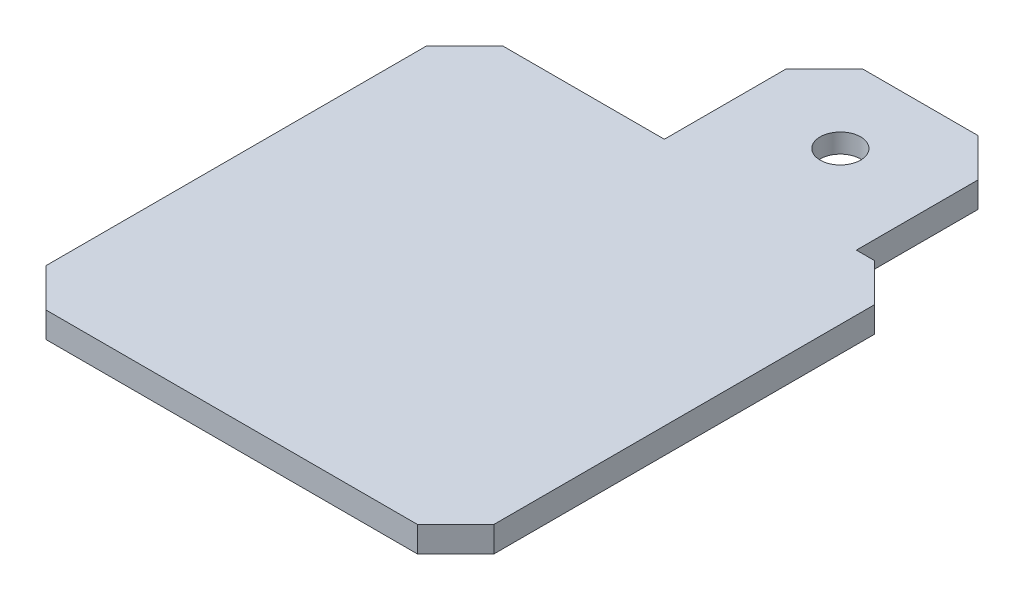
ISO-10303-21;
HEADER;
FILE_DESCRIPTION(('STEP AP214'),'2;1');
FILE_NAME('part.step','',(''),(''),'','','');
FILE_SCHEMA(('AUTOMOTIVE_DESIGN { 1 0 10303 214 1 1 1 1 }'));
ENDSEC;
DATA;
#1=APPLICATION_CONTEXT('core data for automotive mechanical design processes');
#2=APPLICATION_PROTOCOL_DEFINITION('international standard','automotive_design',2000,#1);
#3=PRODUCT_CONTEXT('',#1,'mechanical');
#4=PRODUCT('Part','Part','',(#3));
#5=PRODUCT_RELATED_PRODUCT_CATEGORY('part','',(#4));
#6=PRODUCT_DEFINITION_FORMATION('','',#4);
#7=PRODUCT_DEFINITION_CONTEXT('part definition',#1,'design');
#8=PRODUCT_DEFINITION('design','',#6,#7);
#9=PRODUCT_DEFINITION_SHAPE('','',#8);
#10=(LENGTH_UNIT() NAMED_UNIT(*) SI_UNIT(.MILLI.,.METRE.));
#11=(NAMED_UNIT(*) PLANE_ANGLE_UNIT() SI_UNIT($,.RADIAN.));
#12=(NAMED_UNIT(*) SI_UNIT($,.STERADIAN.) SOLID_ANGLE_UNIT());
#13=UNCERTAINTY_MEASURE_WITH_UNIT(LENGTH_MEASURE(1.E-05),#10,'distance_accuracy_value','');
#14=(GEOMETRIC_REPRESENTATION_CONTEXT(3) GLOBAL_UNCERTAINTY_ASSIGNED_CONTEXT((#13)) GLOBAL_UNIT_ASSIGNED_CONTEXT((#10,
#11,#12)) REPRESENTATION_CONTEXT('',''));
#15=CARTESIAN_POINT('',(0.,0.,0.));
#16=DIRECTION('',(0.,0.,1.));
#17=DIRECTION('',(1.,0.,0.));
#18=AXIS2_PLACEMENT_3D('',#15,#16,#17);
#19=CARTESIAN_POINT('',(5.6,2.,-23.75));
#20=DIRECTION('',(0.,-1.,0.));
#21=DIRECTION('',(0.,0.,-1.));
#22=AXIS2_PLACEMENT_3D('',#19,#20,#21);
#23=CYLINDRICAL_SURFACE('',#22,2.6);
#24=CARTESIAN_POINT('',(5.6,0.,-23.75));
#25=DIRECTION('',(0.,1.,0.));
#26=DIRECTION('',(0.,0.,1.));
#27=AXIS2_PLACEMENT_3D('',#24,#25,#26);
#28=CIRCLE('',#27,2.6);
#29=CARTESIAN_POINT('',(5.6,0.,-21.15));
#30=VERTEX_POINT('',#29);
#31=EDGE_CURVE('E212',#30,#30,#28,.T.);
#32=ORIENTED_EDGE('',*,*,#31,.F.);
#33=EDGE_LOOP('',(#32));
#34=FACE_BOUND('',#33,.T.);
#35=CARTESIAN_POINT('',(5.6,0.5,-23.75));
#36=DIRECTION('',(0.,1.,0.));
#37=DIRECTION('',(0.,0.,1.));
#38=AXIS2_PLACEMENT_3D('',#35,#36,#37);
#39=CIRCLE('',#38,2.6);
#40=CARTESIAN_POINT('',(5.6,0.5,-21.15));
#41=VERTEX_POINT('',#40);
#42=EDGE_CURVE('E193',#41,#41,#39,.T.);
#43=ORIENTED_EDGE('',*,*,#42,.T.);
#44=EDGE_LOOP('',(#43));
#45=FACE_BOUND('',#44,.T.);
#46=ADVANCED_FACE('F49',(#34,#45),#23,.F.);
#47=CARTESIAN_POINT('',(-1.9,2.,0.));
#48=DIRECTION('',(-1.,0.,0.));
#49=DIRECTION('',(0.,0.,1.));
#50=AXIS2_PLACEMENT_3D('',#47,#48,#49);
#51=PLANE('',#50);
#52=DIRECTION('',(0.,0.,-1.));
#53=VECTOR('',#52,1.);
#54=CARTESIAN_POINT('',(-1.9,2.,0.));
#55=LINE('',#54,#53);
#56=CARTESIAN_POINT('',(-1.9,2.,-17.5));
#57=VERTEX_POINT('',#56);
#58=CARTESIAN_POINT('',(-1.9,2.,-27.));
#59=VERTEX_POINT('',#58);
#60=EDGE_CURVE('E165',#57,#59,#55,.T.);
#61=ORIENTED_EDGE('',*,*,#60,.T.);
#62=DIRECTION('',(0.,-1.,0.));
#63=VECTOR('',#62,1.);
#64=CARTESIAN_POINT('',(-1.9,0.,-27.));
#65=LINE('',#64,#63);
#66=CARTESIAN_POINT('',(-1.9,0.,-27.));
#67=VERTEX_POINT('',#66);
#68=EDGE_CURVE('E281',#59,#67,#65,.T.);
#69=ORIENTED_EDGE('',*,*,#68,.T.);
#70=DIRECTION('',(0.,0.,-1.));
#71=VECTOR('',#70,1.);
#72=CARTESIAN_POINT('',(-1.9,0.,0.));
#73=LINE('',#72,#71);
#74=CARTESIAN_POINT('',(-1.9,0.,-17.5));
#75=VERTEX_POINT('',#74);
#76=EDGE_CURVE('E174',#75,#67,#73,.T.);
#77=ORIENTED_EDGE('',*,*,#76,.F.);
#78=DIRECTION('',(0.,-1.,0.));
#79=VECTOR('',#78,1.);
#80=CARTESIAN_POINT('',(-1.9,2.,-17.5));
#81=LINE('',#80,#79);
#82=EDGE_CURVE('E158',#57,#75,#81,.T.);
#83=ORIENTED_EDGE('',*,*,#82,.F.);
#84=EDGE_LOOP('',(#61,#69,#77,#83));
#85=FACE_BOUND('',#84,.T.);
#86=ADVANCED_FACE('F170',(#85),#51,.T.);
#87=CARTESIAN_POINT('',(0.,2.,-17.5));
#88=DIRECTION('',(0.,0.,-1.));
#89=DIRECTION('',(-1.,0.,0.));
#90=AXIS2_PLACEMENT_3D('',#87,#88,#89);
#91=PLANE('',#90);
#92=DIRECTION('',(1.,0.,0.));
#93=VECTOR('',#92,1.);
#94=CARTESIAN_POINT('',(0.,0.,-17.5));
#95=LINE('',#94,#93);
#96=CARTESIAN_POINT('',(-14.5,0.,-17.5));
#97=VERTEX_POINT('',#96);
#98=EDGE_CURVE('E218',#97,#75,#95,.T.);
#99=ORIENTED_EDGE('',*,*,#98,.F.);
#100=DIRECTION('',(0.,1.,0.));
#101=VECTOR('',#100,1.);
#102=CARTESIAN_POINT('',(-14.5,2.,-17.5));
#103=LINE('',#102,#101);
#104=CARTESIAN_POINT('',(-14.5,2.,-17.5));
#105=VERTEX_POINT('',#104);
#106=EDGE_CURVE('E11',#97,#105,#103,.T.);
#107=ORIENTED_EDGE('',*,*,#106,.T.);
#108=DIRECTION('',(1.,0.,0.));
#109=VECTOR('',#108,1.);
#110=CARTESIAN_POINT('',(0.,2.,-17.5));
#111=LINE('',#110,#109);
#112=EDGE_CURVE('E154',#105,#57,#111,.T.);
#113=ORIENTED_EDGE('',*,*,#112,.T.);
#114=ORIENTED_EDGE('',*,*,#82,.T.);
#115=EDGE_LOOP('',(#99,#107,#113,#114));
#116=FACE_BOUND('',#115,.T.);
#117=ADVANCED_FACE('F157',(#116),#91,.T.);
#118=CARTESIAN_POINT('',(-17.5,2.,0.));
#119=DIRECTION('',(-1.,0.,0.));
#120=DIRECTION('',(0.,0.,1.));
#121=AXIS2_PLACEMENT_3D('',#118,#119,#120);
#122=PLANE('',#121);
#123=DIRECTION('',(0.,0.,-1.));
#124=VECTOR('',#123,1.);
#125=CARTESIAN_POINT('',(-17.5,0.,0.));
#126=LINE('',#125,#124);
#127=CARTESIAN_POINT('',(-17.5,0.,15.2));
#128=VERTEX_POINT('',#127);
#129=CARTESIAN_POINT('',(-17.5,0.,-14.5));
#130=VERTEX_POINT('',#129);
#131=EDGE_CURVE('E221',#128,#130,#126,.T.);
#132=ORIENTED_EDGE('',*,*,#131,.F.);
#133=DIRECTION('',(0.,1.,0.));
#134=VECTOR('',#133,1.);
#135=CARTESIAN_POINT('',(-17.5,2.,15.2));
#136=LINE('',#135,#134);
#137=CARTESIAN_POINT('',(-17.5,2.,15.2));
#138=VERTEX_POINT('',#137);
#139=EDGE_CURVE('E59',#128,#138,#136,.T.);
#140=ORIENTED_EDGE('',*,*,#139,.T.);
#141=DIRECTION('',(0.,0.,-1.));
#142=VECTOR('',#141,1.);
#143=CARTESIAN_POINT('',(-17.5,2.,0.));
#144=LINE('',#143,#142);
#145=CARTESIAN_POINT('',(-17.5,2.,-14.5));
#146=VERTEX_POINT('',#145);
#147=EDGE_CURVE('E164',#138,#146,#144,.T.);
#148=ORIENTED_EDGE('',*,*,#147,.T.);
#149=DIRECTION('',(0.,-1.,0.));
#150=VECTOR('',#149,1.);
#151=CARTESIAN_POINT('',(-17.5,2.,-14.5));
#152=LINE('',#151,#150);
#153=EDGE_CURVE('E301',#146,#130,#152,.T.);
#154=ORIENTED_EDGE('',*,*,#153,.T.);
#155=EDGE_LOOP('',(#132,#140,#148,#154));
#156=FACE_BOUND('',#155,.T.);
#157=ADVANCED_FACE('F309',(#156),#122,.T.);
#158=CARTESIAN_POINT('',(0.,2.,18.2));
#159=DIRECTION('',(0.,0.,-1.));
#160=DIRECTION('',(-1.,0.,0.));
#161=AXIS2_PLACEMENT_3D('',#158,#159,#160);
#162=PLANE('',#161);
#163=DIRECTION('',(1.,0.,0.));
#164=VECTOR('',#163,1.);
#165=CARTESIAN_POINT('',(0.,0.,18.2));
#166=LINE('',#165,#164);
#167=CARTESIAN_POINT('',(-14.5,0.,18.2));
#168=VERTEX_POINT('',#167);
#169=CARTESIAN_POINT('',(14.5,0.,18.2));
#170=VERTEX_POINT('',#169);
#171=EDGE_CURVE('E226',#168,#170,#166,.T.);
#172=ORIENTED_EDGE('',*,*,#171,.T.);
#173=DIRECTION('',(0.,1.,0.));
#174=VECTOR('',#173,1.);
#175=CARTESIAN_POINT('',(14.5,2.,18.2));
#176=LINE('',#175,#174);
#177=CARTESIAN_POINT('',(14.5,2.,18.2));
#178=VERTEX_POINT('',#177);
#179=EDGE_CURVE('E294',#170,#178,#176,.T.);
#180=ORIENTED_EDGE('',*,*,#179,.T.);
#181=DIRECTION('',(1.,0.,0.));
#182=VECTOR('',#181,1.);
#183=CARTESIAN_POINT('',(0.,2.,18.2));
#184=LINE('',#183,#182);
#185=CARTESIAN_POINT('',(-14.5,2.,18.2));
#186=VERTEX_POINT('',#185);
#187=EDGE_CURVE('E199',#186,#178,#184,.T.);
#188=ORIENTED_EDGE('',*,*,#187,.F.);
#189=DIRECTION('',(0.,-1.,0.));
#190=VECTOR('',#189,1.);
#191=CARTESIAN_POINT('',(-14.5,0.,18.2));
#192=LINE('',#191,#190);
#193=EDGE_CURVE('E290',#186,#168,#192,.T.);
#194=ORIENTED_EDGE('',*,*,#193,.T.);
#195=EDGE_LOOP('',(#172,#180,#188,#194));
#196=FACE_BOUND('',#195,.T.);
#197=ADVANCED_FACE('F318',(#196),#162,.F.);
#198=CARTESIAN_POINT('',(17.5,2.,0.));
#199=DIRECTION('',(-1.,0.,0.));
#200=DIRECTION('',(0.,0.,1.));
#201=AXIS2_PLACEMENT_3D('',#198,#199,#200);
#202=PLANE('',#201);
#203=DIRECTION('',(0.,0.,-1.));
#204=VECTOR('',#203,1.);
#205=CARTESIAN_POINT('',(17.5,2.,0.));
#206=LINE('',#205,#204);
#207=CARTESIAN_POINT('',(17.5,2.,15.2));
#208=VERTEX_POINT('',#207);
#209=CARTESIAN_POINT('',(17.5,2.,-14.5));
#210=VERTEX_POINT('',#209);
#211=EDGE_CURVE('E203',#208,#210,#206,.T.);
#212=ORIENTED_EDGE('',*,*,#211,.F.);
#213=DIRECTION('',(0.,-1.,0.));
#214=VECTOR('',#213,1.);
#215=CARTESIAN_POINT('',(17.5,2.,15.2));
#216=LINE('',#215,#214);
#217=CARTESIAN_POINT('',(17.5,0.,15.2));
#218=VERTEX_POINT('',#217);
#219=EDGE_CURVE('E286',#208,#218,#216,.T.);
#220=ORIENTED_EDGE('',*,*,#219,.T.);
#221=DIRECTION('',(0.,0.,-1.));
#222=VECTOR('',#221,1.);
#223=CARTESIAN_POINT('',(17.5,0.,0.));
#224=LINE('',#223,#222);
#225=CARTESIAN_POINT('',(17.5,0.,-14.5));
#226=VERTEX_POINT('',#225);
#227=EDGE_CURVE('E230',#218,#226,#224,.T.);
#228=ORIENTED_EDGE('',*,*,#227,.T.);
#229=DIRECTION('',(0.,1.,0.));
#230=VECTOR('',#229,1.);
#231=CARTESIAN_POINT('',(17.5,2.,-14.5));
#232=LINE('',#231,#230);
#233=EDGE_CURVE('E74',#226,#210,#232,.T.);
#234=ORIENTED_EDGE('',*,*,#233,.T.);
#235=EDGE_LOOP('',(#212,#220,#228,#234));
#236=FACE_BOUND('',#235,.T.);
#237=ADVANCED_FACE('F328',(#236),#202,.F.);
#238=CARTESIAN_POINT('',(13.1,2.,-17.5));
#239=VERTEX_POINT('',#238);
#240=CARTESIAN_POINT('',(14.5,2.,-17.5));
#241=VERTEX_POINT('',#240);
#242=EDGE_CURVE('E167',#239,#241,#111,.T.);
#243=ORIENTED_EDGE('',*,*,#242,.T.);
#244=DIRECTION('',(0.,-1.,0.));
#245=VECTOR('',#244,1.);
#246=CARTESIAN_POINT('',(14.5,0.,-17.5));
#247=LINE('',#246,#245);
#248=CARTESIAN_POINT('',(14.5,0.,-17.5));
#249=VERTEX_POINT('',#248);
#250=EDGE_CURVE('E297',#241,#249,#247,.T.);
#251=ORIENTED_EDGE('',*,*,#250,.T.);
#252=CARTESIAN_POINT('',(13.1,0.,-17.5));
#253=VERTEX_POINT('',#252);
#254=EDGE_CURVE('E222',#253,#249,#95,.T.);
#255=ORIENTED_EDGE('',*,*,#254,.F.);
#256=DIRECTION('',(0.,-1.,0.));
#257=VECTOR('',#256,1.);
#258=CARTESIAN_POINT('',(13.1,2.,-17.5));
#259=LINE('',#258,#257);
#260=EDGE_CURVE('E177',#239,#253,#259,.T.);
#261=ORIENTED_EDGE('',*,*,#260,.F.);
#262=EDGE_LOOP('',(#243,#251,#255,#261));
#263=FACE_BOUND('',#262,.T.);
#264=ADVANCED_FACE('F335',(#263),#91,.T.);
#265=CARTESIAN_POINT('',(13.1,2.,0.));
#266=DIRECTION('',(-1.,0.,0.));
#267=DIRECTION('',(0.,0.,1.));
#268=AXIS2_PLACEMENT_3D('',#265,#266,#267);
#269=PLANE('',#268);
#270=DIRECTION('',(0.,0.,-1.));
#271=VECTOR('',#270,1.);
#272=CARTESIAN_POINT('',(13.1,0.,0.));
#273=LINE('',#272,#271);
#274=CARTESIAN_POINT('',(13.1,0.,-27.));
#275=VERTEX_POINT('',#274);
#276=EDGE_CURVE('E190',#253,#275,#273,.T.);
#277=ORIENTED_EDGE('',*,*,#276,.T.);
#278=DIRECTION('',(0.,1.,0.));
#279=VECTOR('',#278,1.);
#280=CARTESIAN_POINT('',(13.1,2.,-27.));
#281=LINE('',#280,#279);
#282=CARTESIAN_POINT('',(13.1,2.,-27.));
#283=VERTEX_POINT('',#282);
#284=EDGE_CURVE('E262',#275,#283,#281,.T.);
#285=ORIENTED_EDGE('',*,*,#284,.T.);
#286=DIRECTION('',(0.,0.,-1.));
#287=VECTOR('',#286,1.);
#288=CARTESIAN_POINT('',(13.1,2.,0.));
#289=LINE('',#288,#287);
#290=EDGE_CURVE('E206',#239,#283,#289,.T.);
#291=ORIENTED_EDGE('',*,*,#290,.F.);
#292=ORIENTED_EDGE('',*,*,#260,.T.);
#293=EDGE_LOOP('',(#277,#285,#291,#292));
#294=FACE_BOUND('',#293,.T.);
#295=ADVANCED_FACE('F362',(#294),#269,.F.);
#296=CARTESIAN_POINT('',(0.,2.,-30.));
#297=DIRECTION('',(0.,0.,1.));
#298=DIRECTION('',(1.,0.,0.));
#299=AXIS2_PLACEMENT_3D('',#296,#297,#298);
#300=PLANE('',#299);
#301=DIRECTION('',(-1.,0.,0.));
#302=VECTOR('',#301,1.);
#303=CARTESIAN_POINT('',(0.,2.,-30.));
#304=LINE('',#303,#302);
#305=CARTESIAN_POINT('',(10.1,2.,-30.));
#306=VERTEX_POINT('',#305);
#307=CARTESIAN_POINT('',(1.09999999999999,2.,-30.));
#308=VERTEX_POINT('',#307);
#309=EDGE_CURVE('E209',#306,#308,#304,.T.);
#310=ORIENTED_EDGE('',*,*,#309,.F.);
#311=DIRECTION('',(0.,-1.,0.));
#312=VECTOR('',#311,1.);
#313=CARTESIAN_POINT('',(10.1,2.,-30.));
#314=LINE('',#313,#312);
#315=CARTESIAN_POINT('',(10.1,0.,-30.));
#316=VERTEX_POINT('',#315);
#317=EDGE_CURVE('E240',#306,#316,#314,.T.);
#318=ORIENTED_EDGE('',*,*,#317,.T.);
#319=DIRECTION('',(-1.,0.,0.));
#320=VECTOR('',#319,1.);
#321=CARTESIAN_POINT('',(0.,0.,-30.));
#322=LINE('',#321,#320);
#323=CARTESIAN_POINT('',(1.09999999999999,0.,-30.));
#324=VERTEX_POINT('',#323);
#325=EDGE_CURVE('E186',#316,#324,#322,.T.);
#326=ORIENTED_EDGE('',*,*,#325,.T.);
#327=DIRECTION('',(0.,1.,0.));
#328=VECTOR('',#327,1.);
#329=CARTESIAN_POINT('',(1.09999999999999,2.,-30.));
#330=LINE('',#329,#328);
#331=EDGE_CURVE('E176',#324,#308,#330,.T.);
#332=ORIENTED_EDGE('',*,*,#331,.T.);
#333=EDGE_LOOP('',(#310,#318,#326,#332));
#334=FACE_BOUND('',#333,.T.);
#335=ADVANCED_FACE('F351',(#334),#300,.F.);
#336=CARTESIAN_POINT('',(0.,2.,0.));
#337=DIRECTION('',(0.,1.,0.));
#338=DIRECTION('',(0.,0.,1.));
#339=AXIS2_PLACEMENT_3D('',#336,#337,#338);
#340=PLANE('',#339);
#341=ORIENTED_EDGE('',*,*,#290,.T.);
#342=DIRECTION('',(0.707106781186546,0.,0.707106781186549));
#343=VECTOR('',#342,1.);
#344=CARTESIAN_POINT('',(20.05,2.,-20.0499999999999));
#345=LINE('',#344,#343);
#346=EDGE_CURVE('E278',#283,#306,#345,.F.);
#347=ORIENTED_EDGE('',*,*,#346,.T.);
#348=ORIENTED_EDGE('',*,*,#309,.T.);
#349=DIRECTION('',(-0.707106781186547,0.,0.707106781186548));
#350=VECTOR('',#349,1.);
#351=CARTESIAN_POINT('',(-14.45,2.,-14.45));
#352=LINE('',#351,#350);
#353=EDGE_CURVE('E184',#308,#59,#352,.T.);
#354=ORIENTED_EDGE('',*,*,#353,.T.);
#355=ORIENTED_EDGE('',*,*,#60,.F.);
#356=ORIENTED_EDGE('',*,*,#112,.F.);
#357=DIRECTION('',(0.707106781186549,0.,-0.707106781186546));
#358=VECTOR('',#357,1.);
#359=CARTESIAN_POINT('',(-16.,2.,-16.));
#360=LINE('',#359,#358);
#361=EDGE_CURVE('E265',#105,#146,#360,.F.);
#362=ORIENTED_EDGE('',*,*,#361,.T.);
#363=ORIENTED_EDGE('',*,*,#147,.F.);
#364=DIRECTION('',(0.707106781186546,0.,0.707106781186549));
#365=VECTOR('',#364,1.);
#366=CARTESIAN_POINT('',(-16.35,2.,16.35));
#367=LINE('',#366,#365);
#368=EDGE_CURVE('E268',#138,#186,#367,.T.);
#369=ORIENTED_EDGE('',*,*,#368,.T.);
#370=ORIENTED_EDGE('',*,*,#187,.T.);
#371=DIRECTION('',(-0.707106781186549,0.,0.707106781186546));
#372=VECTOR('',#371,1.);
#373=CARTESIAN_POINT('',(16.35,2.,16.35));
#374=LINE('',#373,#372);
#375=EDGE_CURVE('E273',#178,#208,#374,.F.);
#376=ORIENTED_EDGE('',*,*,#375,.T.);
#377=ORIENTED_EDGE('',*,*,#211,.T.);
#378=DIRECTION('',(-0.707106781186546,0.,-0.707106781186549));
#379=VECTOR('',#378,1.);
#380=CARTESIAN_POINT('',(16.,2.,-16.));
#381=LINE('',#380,#379);
#382=EDGE_CURVE('E66',#210,#241,#381,.T.);
#383=ORIENTED_EDGE('',*,*,#382,.T.);
#384=ORIENTED_EDGE('',*,*,#242,.F.);
#385=EDGE_LOOP('',(#341,#347,#348,#354,#355,#356,#362,#363,#369,#370,#376,#377,#383,#384));
#386=FACE_BOUND('',#385,.T.);
#387=CARTESIAN_POINT('',(5.6,2.,-23.75));
#388=DIRECTION('',(0.,1.,0.));
#389=DIRECTION('',(0.,0.,1.));
#390=AXIS2_PLACEMENT_3D('',#387,#388,#389);
#391=CIRCLE('',#390,1.58);
#392=CARTESIAN_POINT('',(5.6,2.,-22.17));
#393=VERTEX_POINT('',#392);
#394=EDGE_CURVE('E344',#393,#393,#391,.T.);
#395=ORIENTED_EDGE('',*,*,#394,.F.);
#396=EDGE_LOOP('',(#395));
#397=FACE_BOUND('',#396,.T.);
#398=ADVANCED_FACE('F180',(#386,#397),#340,.T.);
#399=CARTESIAN_POINT('',(0.,0.,0.));
#400=DIRECTION('',(0.,1.,0.));
#401=DIRECTION('',(0.,0.,1.));
#402=AXIS2_PLACEMENT_3D('',#399,#400,#401);
#403=PLANE('',#402);
#404=ORIENTED_EDGE('',*,*,#31,.T.);
#405=EDGE_LOOP('',(#404));
#406=FACE_BOUND('',#405,.T.);
#407=ORIENTED_EDGE('',*,*,#325,.F.);
#408=DIRECTION('',(-0.707106781186546,0.,-0.707106781186549));
#409=VECTOR('',#408,1.);
#410=CARTESIAN_POINT('',(10.1,0.,-30.));
#411=LINE('',#410,#409);
#412=EDGE_CURVE('E259',#316,#275,#411,.F.);
#413=ORIENTED_EDGE('',*,*,#412,.T.);
#414=ORIENTED_EDGE('',*,*,#276,.F.);
#415=ORIENTED_EDGE('',*,*,#254,.T.);
#416=DIRECTION('',(0.707106781186546,0.,0.707106781186549));
#417=VECTOR('',#416,1.);
#418=CARTESIAN_POINT('',(14.5,0.,-17.5));
#419=LINE('',#418,#417);
#420=EDGE_CURVE('E250',#249,#226,#419,.T.);
#421=ORIENTED_EDGE('',*,*,#420,.T.);
#422=ORIENTED_EDGE('',*,*,#227,.F.);
#423=DIRECTION('',(0.707106781186549,0.,-0.707106781186546));
#424=VECTOR('',#423,1.);
#425=CARTESIAN_POINT('',(17.5,0.,15.2));
#426=LINE('',#425,#424);
#427=EDGE_CURVE('E253',#218,#170,#426,.F.);
#428=ORIENTED_EDGE('',*,*,#427,.T.);
#429=ORIENTED_EDGE('',*,*,#171,.F.);
#430=DIRECTION('',(-0.707106781186546,0.,-0.707106781186549));
#431=VECTOR('',#430,1.);
#432=CARTESIAN_POINT('',(-14.5,0.,18.2));
#433=LINE('',#432,#431);
#434=EDGE_CURVE('E247',#168,#128,#433,.T.);
#435=ORIENTED_EDGE('',*,*,#434,.T.);
#436=ORIENTED_EDGE('',*,*,#131,.T.);
#437=DIRECTION('',(-0.707106781186549,0.,0.707106781186546));
#438=VECTOR('',#437,1.);
#439=CARTESIAN_POINT('',(-17.5,0.,-14.5));
#440=LINE('',#439,#438);
#441=EDGE_CURVE('E244',#130,#97,#440,.F.);
#442=ORIENTED_EDGE('',*,*,#441,.T.);
#443=ORIENTED_EDGE('',*,*,#98,.T.);
#444=ORIENTED_EDGE('',*,*,#76,.T.);
#445=DIRECTION('',(0.707106781186547,0.,-0.707106781186548));
#446=VECTOR('',#445,1.);
#447=CARTESIAN_POINT('',(-1.9,0.,-27.));
#448=LINE('',#447,#446);
#449=EDGE_CURVE('E256',#67,#324,#448,.T.);
#450=ORIENTED_EDGE('',*,*,#449,.T.);
#451=EDGE_LOOP('',(#407,#413,#414,#415,#421,#422,#428,#429,#435,#436,#442,#443,#444,#450));
#452=FACE_BOUND('',#451,.T.);
#453=ADVANCED_FACE('F322',(#406,#452),#403,.F.);
#454=CARTESIAN_POINT('',(10.1,2.,-30.));
#455=DIRECTION('',(-0.707106781186549,0.,0.707106781186546));
#456=DIRECTION('',(0.,-1.,0.));
#457=AXIS2_PLACEMENT_3D('',#454,#455,#456);
#458=PLANE('',#457);
#459=ORIENTED_EDGE('',*,*,#346,.F.);
#460=ORIENTED_EDGE('',*,*,#284,.F.);
#461=ORIENTED_EDGE('',*,*,#412,.F.);
#462=ORIENTED_EDGE('',*,*,#317,.F.);
#463=EDGE_LOOP('',(#459,#460,#461,#462));
#464=FACE_BOUND('',#463,.T.);
#465=ADVANCED_FACE('F358',(#464),#458,.F.);
#466=CARTESIAN_POINT('',(-1.9,2.,-27.));
#467=DIRECTION('',(-0.707106781186548,0.,-0.707106781186547));
#468=DIRECTION('',(0.,1.,0.));
#469=AXIS2_PLACEMENT_3D('',#466,#467,#468);
#470=PLANE('',#469);
#471=ORIENTED_EDGE('',*,*,#353,.F.);
#472=ORIENTED_EDGE('',*,*,#331,.F.);
#473=ORIENTED_EDGE('',*,*,#449,.F.);
#474=ORIENTED_EDGE('',*,*,#68,.F.);
#475=EDGE_LOOP('',(#471,#472,#473,#474));
#476=FACE_BOUND('',#475,.T.);
#477=ADVANCED_FACE('F383',(#476),#470,.T.);
#478=CARTESIAN_POINT('',(17.5,2.,15.2));
#479=DIRECTION('',(-0.707106781186546,0.,-0.707106781186549));
#480=DIRECTION('',(0.,-1.,0.));
#481=AXIS2_PLACEMENT_3D('',#478,#479,#480);
#482=PLANE('',#481);
#483=ORIENTED_EDGE('',*,*,#375,.F.);
#484=ORIENTED_EDGE('',*,*,#179,.F.);
#485=ORIENTED_EDGE('',*,*,#427,.F.);
#486=ORIENTED_EDGE('',*,*,#219,.F.);
#487=EDGE_LOOP('',(#483,#484,#485,#486));
#488=FACE_BOUND('',#487,.T.);
#489=ADVANCED_FACE('F327',(#488),#482,.F.);
#490=CARTESIAN_POINT('',(14.5,2.,-17.5));
#491=DIRECTION('',(0.707106781186549,0.,-0.707106781186546));
#492=DIRECTION('',(0.,1.,0.));
#493=AXIS2_PLACEMENT_3D('',#490,#491,#492);
#494=PLANE('',#493);
#495=ORIENTED_EDGE('',*,*,#382,.F.);
#496=ORIENTED_EDGE('',*,*,#233,.F.);
#497=ORIENTED_EDGE('',*,*,#420,.F.);
#498=ORIENTED_EDGE('',*,*,#250,.F.);
#499=EDGE_LOOP('',(#495,#496,#497,#498));
#500=FACE_BOUND('',#499,.T.);
#501=ADVANCED_FACE('F331',(#500),#494,.T.);
#502=CARTESIAN_POINT('',(-14.5,2.,18.2));
#503=DIRECTION('',(-0.707106781186549,0.,0.707106781186546));
#504=DIRECTION('',(0.,1.,0.));
#505=AXIS2_PLACEMENT_3D('',#502,#503,#504);
#506=PLANE('',#505);
#507=ORIENTED_EDGE('',*,*,#368,.F.);
#508=ORIENTED_EDGE('',*,*,#139,.F.);
#509=ORIENTED_EDGE('',*,*,#434,.F.);
#510=ORIENTED_EDGE('',*,*,#193,.F.);
#511=EDGE_LOOP('',(#507,#508,#509,#510));
#512=FACE_BOUND('',#511,.T.);
#513=ADVANCED_FACE('F315',(#512),#506,.T.);
#514=CARTESIAN_POINT('',(-17.5,2.,-14.5));
#515=DIRECTION('',(0.707106781186546,0.,0.707106781186549));
#516=DIRECTION('',(0.,-1.,0.));
#517=AXIS2_PLACEMENT_3D('',#514,#515,#516);
#518=PLANE('',#517);
#519=ORIENTED_EDGE('',*,*,#361,.F.);
#520=ORIENTED_EDGE('',*,*,#106,.F.);
#521=ORIENTED_EDGE('',*,*,#441,.F.);
#522=ORIENTED_EDGE('',*,*,#153,.F.);
#523=EDGE_LOOP('',(#519,#520,#521,#522));
#524=FACE_BOUND('',#523,.T.);
#525=ADVANCED_FACE('F52',(#524),#518,.F.);
#526=CARTESIAN_POINT('',(5.6,0.5,-23.75));
#527=DIRECTION('',(0.,1.,0.));
#528=DIRECTION('',(0.,0.,1.));
#529=AXIS2_PLACEMENT_3D('',#526,#527,#528);
#530=PLANE('',#529);
#531=CARTESIAN_POINT('',(5.6,0.5,-23.75));
#532=DIRECTION('',(0.,1.,0.));
#533=DIRECTION('',(0.,0.,1.));
#534=AXIS2_PLACEMENT_3D('',#531,#532,#533);
#535=CIRCLE('',#534,1.58);
#536=CARTESIAN_POINT('',(5.6,0.5,-22.17));
#537=VERTEX_POINT('',#536);
#538=EDGE_CURVE('E341',#537,#537,#535,.T.);
#539=ORIENTED_EDGE('',*,*,#538,.T.);
#540=EDGE_LOOP('',(#539));
#541=FACE_BOUND('',#540,.T.);
#542=ORIENTED_EDGE('',*,*,#42,.F.);
#543=EDGE_LOOP('',(#542));
#544=FACE_BOUND('',#543,.T.);
#545=ADVANCED_FACE('F405',(#541,#544),#530,.F.);
#546=CARTESIAN_POINT('',(5.6,0.5,-23.75));
#547=DIRECTION('',(0.,1.,0.));
#548=DIRECTION('',(0.,0.,1.));
#549=AXIS2_PLACEMENT_3D('',#546,#547,#548);
#550=CYLINDRICAL_SURFACE('',#549,1.58);
#551=ORIENTED_EDGE('',*,*,#538,.F.);
#552=EDGE_LOOP('',(#551));
#553=FACE_BOUND('',#552,.T.);
#554=ORIENTED_EDGE('',*,*,#394,.T.);
#555=EDGE_LOOP('',(#554));
#556=FACE_BOUND('',#555,.T.);
#557=ADVANCED_FACE('F349',(#553,#556),#550,.F.);
#558=CLOSED_SHELL('',(#46,#86,#117,#157,#197,#237,#264,#295,#335,#398,#453,#465,#477,#489,#501,
#513,#525,#545,#557));
#559=MANIFOLD_SOLID_BREP('B2',#558);
#560=ADVANCED_BREP_SHAPE_REPRESENTATION('',(#18,#559),#14);
#561=SHAPE_DEFINITION_REPRESENTATION(#9,#560);
ENDSEC;
END-ISO-10303-21;
